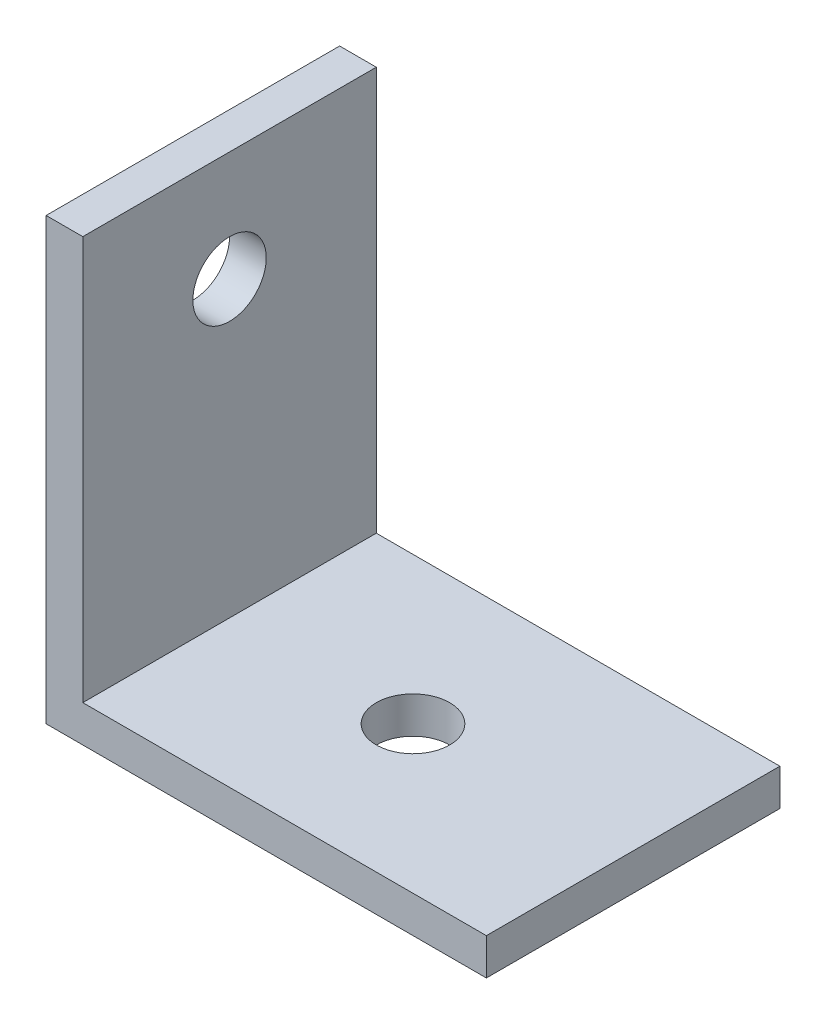
ISO-10303-21;
HEADER;
FILE_DESCRIPTION(('STEP AP214'),'2;1');
FILE_NAME('part.step','',(''),(''),'','','');
FILE_SCHEMA(('AUTOMOTIVE_DESIGN { 1 0 10303 214 1 1 1 1 }'));
ENDSEC;
DATA;
#1=APPLICATION_CONTEXT('core data for automotive mechanical design processes');
#2=APPLICATION_PROTOCOL_DEFINITION('international standard','automotive_design',2000,#1);
#3=PRODUCT_CONTEXT('',#1,'mechanical');
#4=PRODUCT('Part','Part','',(#3));
#5=PRODUCT_RELATED_PRODUCT_CATEGORY('part','',(#4));
#6=PRODUCT_DEFINITION_FORMATION('','',#4);
#7=PRODUCT_DEFINITION_CONTEXT('part definition',#1,'design');
#8=PRODUCT_DEFINITION('design','',#6,#7);
#9=PRODUCT_DEFINITION_SHAPE('','',#8);
#10=(LENGTH_UNIT() NAMED_UNIT(*) SI_UNIT(.MILLI.,.METRE.));
#11=(NAMED_UNIT(*) PLANE_ANGLE_UNIT() SI_UNIT($,.RADIAN.));
#12=(NAMED_UNIT(*) SI_UNIT($,.STERADIAN.) SOLID_ANGLE_UNIT());
#13=UNCERTAINTY_MEASURE_WITH_UNIT(LENGTH_MEASURE(1.E-05),#10,'distance_accuracy_value','');
#14=(GEOMETRIC_REPRESENTATION_CONTEXT(3) GLOBAL_UNCERTAINTY_ASSIGNED_CONTEXT((#13)) GLOBAL_UNIT_ASSIGNED_CONTEXT((#10,
#11,#12)) REPRESENTATION_CONTEXT('',''));
#15=CARTESIAN_POINT('',(0.,0.,0.));
#16=DIRECTION('',(0.,0.,1.));
#17=DIRECTION('',(1.,0.,0.));
#18=AXIS2_PLACEMENT_3D('',#15,#16,#17);
#19=CARTESIAN_POINT('',(38.1,0.,25.4));
#20=DIRECTION('',(0.,1.,0.));
#21=DIRECTION('',(-1.,0.,0.));
#22=AXIS2_PLACEMENT_3D('',#19,#20,#21);
#23=PLANE('',#22);
#24=CARTESIAN_POINT('',(19.05,0.,12.7));
#25=DIRECTION('',(0.,1.,0.));
#26=DIRECTION('',(-1.,0.,0.));
#27=AXIS2_PLACEMENT_3D('',#24,#25,#26);
#28=CIRCLE('',#27,3.175);
#29=CARTESIAN_POINT('',(15.875,0.,12.7));
#30=VERTEX_POINT('',#29);
#31=EDGE_CURVE('E120',#30,#30,#28,.T.);
#32=ORIENTED_EDGE('',*,*,#31,.T.);
#33=EDGE_LOOP('',(#32));
#34=FACE_BOUND('',#33,.T.);
#35=DIRECTION('',(1.,0.,0.));
#36=VECTOR('',#35,1.);
#37=CARTESIAN_POINT('',(38.1,0.,0.));
#38=LINE('',#37,#36);
#39=CARTESIAN_POINT('',(0.,0.,0.));
#40=VERTEX_POINT('',#39);
#41=CARTESIAN_POINT('',(38.1,0.,0.));
#42=VERTEX_POINT('',#41);
#43=EDGE_CURVE('E116',#40,#42,#38,.T.);
#44=ORIENTED_EDGE('',*,*,#43,.T.);
#45=DIRECTION('',(0.,0.,-1.));
#46=VECTOR('',#45,1.);
#47=CARTESIAN_POINT('',(38.1,0.,25.4));
#48=LINE('',#47,#46);
#49=CARTESIAN_POINT('',(38.1,0.,25.4));
#50=VERTEX_POINT('',#49);
#51=EDGE_CURVE('E11',#50,#42,#48,.T.);
#52=ORIENTED_EDGE('',*,*,#51,.F.);
#53=DIRECTION('',(1.,0.,0.));
#54=VECTOR('',#53,1.);
#55=CARTESIAN_POINT('',(38.1,0.,25.4));
#56=LINE('',#55,#54);
#57=CARTESIAN_POINT('',(0.,0.,25.4));
#58=VERTEX_POINT('',#57);
#59=EDGE_CURVE('E127',#58,#50,#56,.T.);
#60=ORIENTED_EDGE('',*,*,#59,.F.);
#61=DIRECTION('',(0.,0.,-1.));
#62=VECTOR('',#61,1.);
#63=CARTESIAN_POINT('',(0.,0.,25.4));
#64=LINE('',#63,#62);
#65=EDGE_CURVE('E112',#58,#40,#64,.T.);
#66=ORIENTED_EDGE('',*,*,#65,.T.);
#67=EDGE_LOOP('',(#44,#52,#60,#66));
#68=FACE_BOUND('',#67,.T.);
#69=ADVANCED_FACE('F32',(#34,#68),#23,.F.);
#70=CARTESIAN_POINT('',(38.1,3.17499999999999,25.4));
#71=DIRECTION('',(-1.,0.,0.));
#72=DIRECTION('',(0.,0.,1.));
#73=AXIS2_PLACEMENT_3D('',#70,#71,#72);
#74=PLANE('',#73);
#75=DIRECTION('',(0.,1.,0.));
#76=VECTOR('',#75,1.);
#77=CARTESIAN_POINT('',(38.1,3.17499999999999,0.));
#78=LINE('',#77,#76);
#79=CARTESIAN_POINT('',(38.1,3.17499999999999,0.));
#80=VERTEX_POINT('',#79);
#81=EDGE_CURVE('E119',#42,#80,#78,.T.);
#82=ORIENTED_EDGE('',*,*,#81,.T.);
#83=DIRECTION('',(0.,0.,-1.));
#84=VECTOR('',#83,1.);
#85=CARTESIAN_POINT('',(38.1,3.17499999999999,25.4));
#86=LINE('',#85,#84);
#87=CARTESIAN_POINT('',(38.1,3.17499999999999,25.4));
#88=VERTEX_POINT('',#87);
#89=EDGE_CURVE('E40',#88,#80,#86,.T.);
#90=ORIENTED_EDGE('',*,*,#89,.F.);
#91=DIRECTION('',(0.,1.,0.));
#92=VECTOR('',#91,1.);
#93=CARTESIAN_POINT('',(38.1,3.17499999999999,25.4));
#94=LINE('',#93,#92);
#95=EDGE_CURVE('E85',#50,#88,#94,.T.);
#96=ORIENTED_EDGE('',*,*,#95,.F.);
#97=ORIENTED_EDGE('',*,*,#51,.T.);
#98=EDGE_LOOP('',(#82,#90,#96,#97));
#99=FACE_BOUND('',#98,.T.);
#100=ADVANCED_FACE('F153',(#99),#74,.F.);
#101=CARTESIAN_POINT('',(3.175,3.175,25.4));
#102=DIRECTION('',(0.,-1.,0.));
#103=DIRECTION('',(1.,0.,0.));
#104=AXIS2_PLACEMENT_3D('',#101,#102,#103);
#105=PLANE('',#104);
#106=CARTESIAN_POINT('',(19.05,3.17499999999999,12.7));
#107=DIRECTION('',(0.,1.,0.));
#108=DIRECTION('',(-1.,0.,0.));
#109=AXIS2_PLACEMENT_3D('',#106,#107,#108);
#110=CIRCLE('',#109,3.175);
#111=CARTESIAN_POINT('',(15.875,3.17499999999999,12.7));
#112=VERTEX_POINT('',#111);
#113=EDGE_CURVE('E161',#112,#112,#110,.T.);
#114=ORIENTED_EDGE('',*,*,#113,.F.);
#115=EDGE_LOOP('',(#114));
#116=FACE_BOUND('',#115,.T.);
#117=DIRECTION('',(-1.,0.,0.));
#118=VECTOR('',#117,1.);
#119=CARTESIAN_POINT('',(3.175,3.175,0.));
#120=LINE('',#119,#118);
#121=CARTESIAN_POINT('',(3.175,3.175,0.));
#122=VERTEX_POINT('',#121);
#123=EDGE_CURVE('E122',#80,#122,#120,.T.);
#124=ORIENTED_EDGE('',*,*,#123,.T.);
#125=DIRECTION('',(0.,0.,-1.));
#126=VECTOR('',#125,1.);
#127=CARTESIAN_POINT('',(3.175,3.175,25.4));
#128=LINE('',#127,#126);
#129=CARTESIAN_POINT('',(3.175,3.175,25.4));
#130=VERTEX_POINT('',#129);
#131=EDGE_CURVE('E107',#130,#122,#128,.T.);
#132=ORIENTED_EDGE('',*,*,#131,.F.);
#133=DIRECTION('',(-1.,0.,0.));
#134=VECTOR('',#133,1.);
#135=CARTESIAN_POINT('',(3.175,3.175,25.4));
#136=LINE('',#135,#134);
#137=EDGE_CURVE('E98',#88,#130,#136,.T.);
#138=ORIENTED_EDGE('',*,*,#137,.F.);
#139=ORIENTED_EDGE('',*,*,#89,.T.);
#140=EDGE_LOOP('',(#124,#132,#138,#139));
#141=FACE_BOUND('',#140,.T.);
#142=ADVANCED_FACE('F133',(#116,#141),#105,.F.);
#143=CARTESIAN_POINT('',(3.175,38.1,25.4));
#144=DIRECTION('',(-1.,0.,0.));
#145=DIRECTION('',(0.,-1.,0.));
#146=AXIS2_PLACEMENT_3D('',#143,#144,#145);
#147=PLANE('',#146);
#148=CARTESIAN_POINT('',(3.175,28.575,12.7));
#149=DIRECTION('',(1.,0.,0.));
#150=DIRECTION('',(0.,1.,0.));
#151=AXIS2_PLACEMENT_3D('',#148,#149,#150);
#152=CIRCLE('',#151,3.175);
#153=CARTESIAN_POINT('',(3.175,31.75,12.7));
#154=VERTEX_POINT('',#153);
#155=EDGE_CURVE('E167',#154,#154,#152,.T.);
#156=ORIENTED_EDGE('',*,*,#155,.F.);
#157=EDGE_LOOP('',(#156));
#158=FACE_BOUND('',#157,.T.);
#159=DIRECTION('',(0.,1.,0.));
#160=VECTOR('',#159,1.);
#161=CARTESIAN_POINT('',(3.175,38.1,0.));
#162=LINE('',#161,#160);
#163=CARTESIAN_POINT('',(3.175,38.1,0.));
#164=VERTEX_POINT('',#163);
#165=EDGE_CURVE('E106',#122,#164,#162,.T.);
#166=ORIENTED_EDGE('',*,*,#165,.T.);
#167=DIRECTION('',(0.,0.,-1.));
#168=VECTOR('',#167,1.);
#169=CARTESIAN_POINT('',(3.175,38.1,25.4));
#170=LINE('',#169,#168);
#171=CARTESIAN_POINT('',(3.175,38.1,25.4));
#172=VERTEX_POINT('',#171);
#173=EDGE_CURVE('E103',#172,#164,#170,.T.);
#174=ORIENTED_EDGE('',*,*,#173,.F.);
#175=DIRECTION('',(0.,1.,0.));
#176=VECTOR('',#175,1.);
#177=CARTESIAN_POINT('',(3.175,38.1,25.4));
#178=LINE('',#177,#176);
#179=EDGE_CURVE('E92',#130,#172,#178,.T.);
#180=ORIENTED_EDGE('',*,*,#179,.F.);
#181=ORIENTED_EDGE('',*,*,#131,.T.);
#182=EDGE_LOOP('',(#166,#174,#180,#181));
#183=FACE_BOUND('',#182,.T.);
#184=ADVANCED_FACE('F104',(#158,#183),#147,.F.);
#185=CARTESIAN_POINT('',(0.,38.1,25.4));
#186=DIRECTION('',(0.,-1.,0.));
#187=DIRECTION('',(0.,0.,-1.));
#188=AXIS2_PLACEMENT_3D('',#185,#186,#187);
#189=PLANE('',#188);
#190=DIRECTION('',(-1.,0.,0.));
#191=VECTOR('',#190,1.);
#192=CARTESIAN_POINT('',(0.,38.1,0.));
#193=LINE('',#192,#191);
#194=CARTESIAN_POINT('',(0.,38.1,0.));
#195=VERTEX_POINT('',#194);
#196=EDGE_CURVE('E71',#164,#195,#193,.T.);
#197=ORIENTED_EDGE('',*,*,#196,.T.);
#198=DIRECTION('',(0.,0.,-1.));
#199=VECTOR('',#198,1.);
#200=CARTESIAN_POINT('',(0.,38.1,25.4));
#201=LINE('',#200,#199);
#202=CARTESIAN_POINT('',(0.,38.1,25.4));
#203=VERTEX_POINT('',#202);
#204=EDGE_CURVE('E108',#203,#195,#201,.T.);
#205=ORIENTED_EDGE('',*,*,#204,.F.);
#206=DIRECTION('',(-1.,0.,0.));
#207=VECTOR('',#206,1.);
#208=CARTESIAN_POINT('',(0.,38.1,25.4));
#209=LINE('',#208,#207);
#210=EDGE_CURVE('E96',#172,#203,#209,.T.);
#211=ORIENTED_EDGE('',*,*,#210,.F.);
#212=ORIENTED_EDGE('',*,*,#173,.T.);
#213=EDGE_LOOP('',(#197,#205,#211,#212));
#214=FACE_BOUND('',#213,.T.);
#215=ADVANCED_FACE('F110',(#214),#189,.F.);
#216=CARTESIAN_POINT('',(0.,0.,25.4));
#217=DIRECTION('',(1.,0.,0.));
#218=DIRECTION('',(0.,0.,-1.));
#219=AXIS2_PLACEMENT_3D('',#216,#217,#218);
#220=PLANE('',#219);
#221=CARTESIAN_POINT('',(0.,28.575,12.7));
#222=DIRECTION('',(1.,0.,0.));
#223=DIRECTION('',(0.,1.,0.));
#224=AXIS2_PLACEMENT_3D('',#221,#222,#223);
#225=CIRCLE('',#224,3.175);
#226=CARTESIAN_POINT('',(0.,31.75,12.7));
#227=VERTEX_POINT('',#226);
#228=EDGE_CURVE('E164',#227,#227,#225,.T.);
#229=ORIENTED_EDGE('',*,*,#228,.T.);
#230=EDGE_LOOP('',(#229));
#231=FACE_BOUND('',#230,.T.);
#232=DIRECTION('',(0.,-1.,0.));
#233=VECTOR('',#232,1.);
#234=CARTESIAN_POINT('',(0.,0.,0.));
#235=LINE('',#234,#233);
#236=EDGE_CURVE('E77',#195,#40,#235,.T.);
#237=ORIENTED_EDGE('',*,*,#236,.T.);
#238=ORIENTED_EDGE('',*,*,#65,.F.);
#239=DIRECTION('',(0.,-1.,0.));
#240=VECTOR('',#239,1.);
#241=CARTESIAN_POINT('',(0.,0.,25.4));
#242=LINE('',#241,#240);
#243=EDGE_CURVE('E48',#203,#58,#242,.T.);
#244=ORIENTED_EDGE('',*,*,#243,.F.);
#245=ORIENTED_EDGE('',*,*,#204,.T.);
#246=EDGE_LOOP('',(#237,#238,#244,#245));
#247=FACE_BOUND('',#246,.T.);
#248=ADVANCED_FACE('F140',(#231,#247),#220,.F.);
#249=CARTESIAN_POINT('',(0.,0.,25.4));
#250=DIRECTION('',(0.,0.,-1.));
#251=DIRECTION('',(-1.,0.,0.));
#252=AXIS2_PLACEMENT_3D('',#249,#250,#251);
#253=PLANE('',#252);
#254=ORIENTED_EDGE('',*,*,#59,.T.);
#255=ORIENTED_EDGE('',*,*,#95,.T.);
#256=ORIENTED_EDGE('',*,*,#137,.T.);
#257=ORIENTED_EDGE('',*,*,#179,.T.);
#258=ORIENTED_EDGE('',*,*,#210,.T.);
#259=ORIENTED_EDGE('',*,*,#243,.T.);
#260=EDGE_LOOP('',(#254,#255,#256,#257,#258,#259));
#261=FACE_BOUND('',#260,.T.);
#262=ADVANCED_FACE('F94',(#261),#253,.F.);
#263=CARTESIAN_POINT('',(0.,0.,0.));
#264=DIRECTION('',(0.,0.,-1.));
#265=DIRECTION('',(-1.,0.,0.));
#266=AXIS2_PLACEMENT_3D('',#263,#264,#265);
#267=PLANE('',#266);
#268=ORIENTED_EDGE('',*,*,#43,.F.);
#269=ORIENTED_EDGE('',*,*,#236,.F.);
#270=ORIENTED_EDGE('',*,*,#196,.F.);
#271=ORIENTED_EDGE('',*,*,#165,.F.);
#272=ORIENTED_EDGE('',*,*,#123,.F.);
#273=ORIENTED_EDGE('',*,*,#81,.F.);
#274=EDGE_LOOP('',(#268,#269,#270,#271,#272,#273));
#275=FACE_BOUND('',#274,.T.);
#276=ADVANCED_FACE('F136',(#275),#267,.T.);
#277=CARTESIAN_POINT('',(19.05,0.,12.7));
#278=DIRECTION('',(0.,1.,0.));
#279=DIRECTION('',(-1.,0.,0.));
#280=AXIS2_PLACEMENT_3D('',#277,#278,#279);
#281=CYLINDRICAL_SURFACE('',#280,3.175);
#282=ORIENTED_EDGE('',*,*,#31,.F.);
#283=EDGE_LOOP('',(#282));
#284=FACE_BOUND('',#283,.T.);
#285=ORIENTED_EDGE('',*,*,#113,.T.);
#286=EDGE_LOOP('',(#285));
#287=FACE_BOUND('',#286,.T.);
#288=ADVANCED_FACE('F177',(#284,#287),#281,.F.);
#289=CARTESIAN_POINT('',(0.,28.575,12.7));
#290=DIRECTION('',(1.,0.,0.));
#291=DIRECTION('',(0.,1.,0.));
#292=AXIS2_PLACEMENT_3D('',#289,#290,#291);
#293=CYLINDRICAL_SURFACE('',#292,3.175);
#294=ORIENTED_EDGE('',*,*,#228,.F.);
#295=EDGE_LOOP('',(#294));
#296=FACE_BOUND('',#295,.T.);
#297=ORIENTED_EDGE('',*,*,#155,.T.);
#298=EDGE_LOOP('',(#297));
#299=FACE_BOUND('',#298,.T.);
#300=ADVANCED_FACE('F174',(#296,#299),#293,.F.);
#301=CLOSED_SHELL('',(#69,#100,#142,#184,#215,#248,#262,#276,#288,#300));
#302=MANIFOLD_SOLID_BREP('B2',#301);
#303=ADVANCED_BREP_SHAPE_REPRESENTATION('',(#18,#302),#14);
#304=SHAPE_DEFINITION_REPRESENTATION(#9,#303);
ENDSEC;
END-ISO-10303-21;
